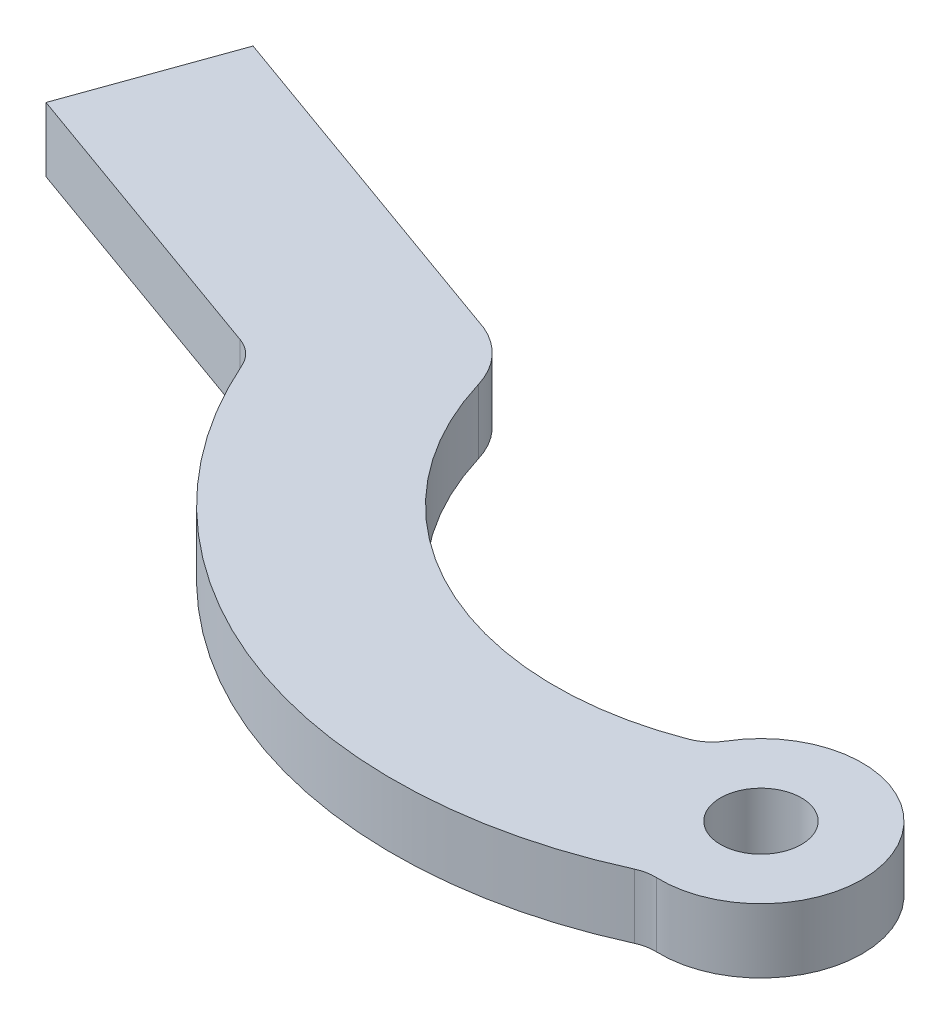
ISO-10303-21;
HEADER;
FILE_DESCRIPTION(('STEP AP214'),'2;1');
FILE_NAME('part.step','',(''),(''),'','','');
FILE_SCHEMA(('AUTOMOTIVE_DESIGN { 1 0 10303 214 1 1 1 1 }'));
ENDSEC;
DATA;
#1=APPLICATION_CONTEXT('core data for automotive mechanical design processes');
#2=APPLICATION_PROTOCOL_DEFINITION('international standard','automotive_design',2000,#1);
#3=PRODUCT_CONTEXT('',#1,'mechanical');
#4=PRODUCT('Part','Part','',(#3));
#5=PRODUCT_RELATED_PRODUCT_CATEGORY('part','',(#4));
#6=PRODUCT_DEFINITION_FORMATION('','',#4);
#7=PRODUCT_DEFINITION_CONTEXT('part definition',#1,'design');
#8=PRODUCT_DEFINITION('design','',#6,#7);
#9=PRODUCT_DEFINITION_SHAPE('','',#8);
#10=(LENGTH_UNIT() NAMED_UNIT(*) SI_UNIT(.MILLI.,.METRE.));
#11=(NAMED_UNIT(*) PLANE_ANGLE_UNIT() SI_UNIT($,.RADIAN.));
#12=(NAMED_UNIT(*) SI_UNIT($,.STERADIAN.) SOLID_ANGLE_UNIT());
#13=UNCERTAINTY_MEASURE_WITH_UNIT(LENGTH_MEASURE(1.E-05),#10,'distance_accuracy_value','');
#14=(GEOMETRIC_REPRESENTATION_CONTEXT(3) GLOBAL_UNCERTAINTY_ASSIGNED_CONTEXT((#13)) GLOBAL_UNIT_ASSIGNED_CONTEXT((#10,
#11,#12)) REPRESENTATION_CONTEXT('',''));
#15=CARTESIAN_POINT('',(0.,0.,0.));
#16=DIRECTION('',(0.,0.,1.));
#17=DIRECTION('',(1.,0.,0.));
#18=AXIS2_PLACEMENT_3D('',#15,#16,#17);
#19=CARTESIAN_POINT('',(-5.43070103723116,1.59,-8.07463832148617));
#20=DIRECTION('',(0.,-1.,0.));
#21=DIRECTION('',(0.,0.,-1.));
#22=AXIS2_PLACEMENT_3D('',#19,#20,#21);
#23=CYLINDRICAL_SURFACE('',#22,7.73099675154589);
#24=CARTESIAN_POINT('',(-5.43070103723116,0.,-8.07463832148617));
#25=DIRECTION('',(0.,1.,0.));
#26=DIRECTION('',(0.,0.,1.));
#27=AXIS2_PLACEMENT_3D('',#24,#25,#26);
#28=CIRCLE('',#27,7.73099675154589);
#29=CARTESIAN_POINT('',(-12.8368744273472,0.,-5.85722846132268));
#30=VERTEX_POINT('',#29);
#31=CARTESIAN_POINT('',(-2.64329068294313,0.,-0.863629079416032));
#32=VERTEX_POINT('',#31);
#33=EDGE_CURVE('E147',#30,#32,#28,.T.);
#34=ORIENTED_EDGE('',*,*,#33,.F.);
#35=DIRECTION('',(0.,-1.,0.));
#36=VECTOR('',#35,1.);
#37=CARTESIAN_POINT('',(-12.8368744273472,1.59,-5.85722846132268));
#38=LINE('',#37,#36);
#39=CARTESIAN_POINT('',(-12.8368744273472,1.59,-5.85722846132268));
#40=VERTEX_POINT('',#39);
#41=EDGE_CURVE('E11',#40,#30,#38,.T.);
#42=ORIENTED_EDGE('',*,*,#41,.F.);
#43=CARTESIAN_POINT('',(-5.43070103723116,1.59,-8.07463832148617));
#44=DIRECTION('',(0.,1.,0.));
#45=DIRECTION('',(0.,0.,1.));
#46=AXIS2_PLACEMENT_3D('',#43,#44,#45);
#47=CIRCLE('',#46,7.73099675154589);
#48=CARTESIAN_POINT('',(-2.64329068294313,1.59,-0.863629079416032));
#49=VERTEX_POINT('',#48);
#50=EDGE_CURVE('E239',#40,#49,#47,.T.);
#51=ORIENTED_EDGE('',*,*,#50,.T.);
#52=DIRECTION('',(0.,-1.,0.));
#53=VECTOR('',#52,1.);
#54=CARTESIAN_POINT('',(-2.64329068294313,1.59,-0.863629079416032));
#55=LINE('',#54,#53);
#56=EDGE_CURVE('E52',#49,#32,#55,.T.);
#57=ORIENTED_EDGE('',*,*,#56,.T.);
#58=EDGE_LOOP('',(#34,#42,#51,#57));
#59=FACE_BOUND('',#58,.T.);
#60=ADVANCED_FACE('F35',(#59),#23,.F.);
#61=CARTESIAN_POINT('',(-14.7596392078908,1.59,-5.28155228435894));
#62=DIRECTION('',(0.,-1.,0.));
#63=DIRECTION('',(0.,0.,-1.));
#64=AXIS2_PLACEMENT_3D('',#61,#62,#63);
#65=CYLINDRICAL_SURFACE('',#64,2.0070942832918);
#66=CARTESIAN_POINT('',(-14.7596392078908,0.,-5.28155228435894));
#67=DIRECTION('',(0.,1.,0.));
#68=DIRECTION('',(0.,0.,1.));
#69=AXIS2_PLACEMENT_3D('',#66,#67,#68);
#70=CIRCLE('',#69,2.0070942832918);
#71=CARTESIAN_POINT('',(-13.9825676529484,0.,-7.13211632284073));
#72=VERTEX_POINT('',#71);
#73=EDGE_CURVE('E149',#30,#72,#70,.T.);
#74=ORIENTED_EDGE('',*,*,#73,.T.);
#75=DIRECTION('',(0.,-1.,0.));
#76=VECTOR('',#75,1.);
#77=CARTESIAN_POINT('',(-13.9825676529484,1.59,-7.13211632284073));
#78=LINE('',#77,#76);
#79=CARTESIAN_POINT('',(-13.9825676529484,1.59,-7.13211632284073));
#80=VERTEX_POINT('',#79);
#81=EDGE_CURVE('E44',#80,#72,#78,.T.);
#82=ORIENTED_EDGE('',*,*,#81,.F.);
#83=CARTESIAN_POINT('',(-14.7596392078908,1.59,-5.28155228435894));
#84=DIRECTION('',(0.,1.,0.));
#85=DIRECTION('',(0.,0.,1.));
#86=AXIS2_PLACEMENT_3D('',#83,#84,#85);
#87=CIRCLE('',#86,2.0070942832918);
#88=EDGE_CURVE('E241',#40,#80,#87,.T.);
#89=ORIENTED_EDGE('',*,*,#88,.F.);
#90=ORIENTED_EDGE('',*,*,#41,.T.);
#91=EDGE_LOOP('',(#74,#82,#89,#90));
#92=FACE_BOUND('',#91,.T.);
#93=ADVANCED_FACE('F195',(#92),#65,.T.);
#94=CARTESIAN_POINT('',(0.674338091003313,1.59,-1.88288824390138));
#95=DIRECTION('',(-0.337169045501656,0.,0.941444121950688));
#96=DIRECTION('',(0.941444121950688,0.,0.337169045501656));
#97=AXIS2_PLACEMENT_3D('',#94,#95,#96);
#98=PLANE('',#97);
#99=DIRECTION('',(-0.941444121950688,0.,-0.337169045501656));
#100=VECTOR('',#99,1.);
#101=CARTESIAN_POINT('',(0.674338091003313,0.,-1.88288824390138));
#102=LINE('',#101,#100);
#103=CARTESIAN_POINT('',(-22.8617649577639,0.,-10.3121143814428));
#104=VERTEX_POINT('',#103);
#105=EDGE_CURVE('E152',#72,#104,#102,.T.);
#106=ORIENTED_EDGE('',*,*,#105,.T.);
#107=DIRECTION('',(0.,-1.,0.));
#108=VECTOR('',#107,1.);
#109=CARTESIAN_POINT('',(-22.8617649577639,1.59,-10.3121143814428));
#110=LINE('',#109,#108);
#111=CARTESIAN_POINT('',(-22.8617649577639,1.59,-10.3121143814428));
#112=VERTEX_POINT('',#111);
#113=EDGE_CURVE('E183',#112,#104,#110,.T.);
#114=ORIENTED_EDGE('',*,*,#113,.F.);
#115=DIRECTION('',(-0.941444121950688,0.,-0.337169045501656));
#116=VECTOR('',#115,1.);
#117=CARTESIAN_POINT('',(0.674338091003313,1.59,-1.88288824390138));
#118=LINE('',#117,#116);
#119=EDGE_CURVE('E191',#80,#112,#118,.T.);
#120=ORIENTED_EDGE('',*,*,#119,.F.);
#121=ORIENTED_EDGE('',*,*,#81,.T.);
#122=EDGE_LOOP('',(#106,#114,#120,#121));
#123=FACE_BOUND('',#122,.T.);
#124=ADVANCED_FACE('F188',(#123),#98,.F.);
#125=CARTESIAN_POINT('',(-23.5361030487672,1.59,-8.42922613754141));
#126=DIRECTION('',(0.941444121950688,0.,0.337169045501656));
#127=DIRECTION('',(0.337169045501656,0.,-0.941444121950688));
#128=AXIS2_PLACEMENT_3D('',#125,#126,#127);
#129=PLANE('',#128);
#130=DIRECTION('',(-0.337169045501656,0.,0.941444121950688));
#131=VECTOR('',#130,1.);
#132=CARTESIAN_POINT('',(-23.5361030487672,0.,-8.42922613754141));
#133=LINE('',#132,#131);
#134=CARTESIAN_POINT('',(-24.2104411397705,0.,-6.54633789364004));
#135=VERTEX_POINT('',#134);
#136=EDGE_CURVE('E155',#104,#135,#133,.T.);
#137=ORIENTED_EDGE('',*,*,#136,.T.);
#138=DIRECTION('',(0.,-1.,0.));
#139=VECTOR('',#138,1.);
#140=CARTESIAN_POINT('',(-24.2104411397705,1.59,-6.54633789364004));
#141=LINE('',#140,#139);
#142=CARTESIAN_POINT('',(-24.2104411397705,1.59,-6.54633789364004));
#143=VERTEX_POINT('',#142);
#144=EDGE_CURVE('E181',#143,#135,#141,.T.);
#145=ORIENTED_EDGE('',*,*,#144,.F.);
#146=DIRECTION('',(-0.337169045501656,0.,0.941444121950688));
#147=VECTOR('',#146,1.);
#148=CARTESIAN_POINT('',(-23.5361030487672,1.59,-8.42922613754141));
#149=LINE('',#148,#147);
#150=EDGE_CURVE('E246',#112,#143,#149,.T.);
#151=ORIENTED_EDGE('',*,*,#150,.F.);
#152=ORIENTED_EDGE('',*,*,#113,.T.);
#153=EDGE_LOOP('',(#137,#145,#151,#152));
#154=FACE_BOUND('',#153,.T.);
#155=ADVANCED_FACE('F206',(#154),#129,.F.);
#156=CARTESIAN_POINT('',(-0.674338091003315,1.59,1.88288824390138));
#157=DIRECTION('',(-0.337169045501657,0.,0.941444121950688));
#158=DIRECTION('',(0.941444121950688,0.,0.337169045501657));
#159=AXIS2_PLACEMENT_3D('',#156,#157,#158);
#160=PLANE('',#159);
#161=DIRECTION('',(-0.941444121950688,0.,-0.337169045501657));
#162=VECTOR('',#161,1.);
#163=CARTESIAN_POINT('',(-0.674338091003315,0.,1.88288824390138));
#164=LINE('',#163,#162);
#165=CARTESIAN_POINT('',(-16.7382082650292,0.,-3.87023044615566));
#166=VERTEX_POINT('',#165);
#167=EDGE_CURVE('E158',#166,#135,#164,.T.);
#168=ORIENTED_EDGE('',*,*,#167,.F.);
#169=DIRECTION('',(0.,-1.,0.));
#170=VECTOR('',#169,1.);
#171=CARTESIAN_POINT('',(-16.7382082650292,1.59,-3.87023044615566));
#172=LINE('',#171,#170);
#173=CARTESIAN_POINT('',(-16.7382082650292,1.59,-3.87023044615566));
#174=VERTEX_POINT('',#173);
#175=EDGE_CURVE('E179',#174,#166,#172,.T.);
#176=ORIENTED_EDGE('',*,*,#175,.F.);
#177=DIRECTION('',(-0.941444121950688,0.,-0.337169045501657));
#178=VECTOR('',#177,1.);
#179=CARTESIAN_POINT('',(-0.674338091003315,1.59,1.88288824390138));
#180=LINE('',#179,#178);
#181=EDGE_CURVE('E248',#174,#143,#180,.T.);
#182=ORIENTED_EDGE('',*,*,#181,.T.);
#183=ORIENTED_EDGE('',*,*,#144,.T.);
#184=EDGE_LOOP('',(#168,#176,#182,#183));
#185=FACE_BOUND('',#184,.T.);
#186=ADVANCED_FACE('F209',(#185),#160,.T.);
#187=CARTESIAN_POINT('',(-17.0753773105309,1.59,-2.92878632420497));
#188=DIRECTION('',(0.,-1.,0.));
#189=DIRECTION('',(0.,0.,-1.));
#190=AXIS2_PLACEMENT_3D('',#187,#188,#189);
#191=CYLINDRICAL_SURFACE('',#190,1.);
#192=CARTESIAN_POINT('',(-17.0753773105309,0.,-2.92878632420497));
#193=DIRECTION('',(0.,1.,0.));
#194=DIRECTION('',(0.,0.,1.));
#195=AXIS2_PLACEMENT_3D('',#192,#193,#194);
#196=CIRCLE('',#195,1.);
#197=CARTESIAN_POINT('',(-16.160706095028,0.,-3.33298499754579));
#198=VERTEX_POINT('',#197);
#199=EDGE_CURVE('E161',#198,#166,#196,.T.);
#200=ORIENTED_EDGE('',*,*,#199,.F.);
#201=DIRECTION('',(0.,-1.,0.));
#202=VECTOR('',#201,1.);
#203=CARTESIAN_POINT('',(-16.160706095028,1.59,-3.33298499754579));
#204=LINE('',#203,#202);
#205=CARTESIAN_POINT('',(-16.160706095028,1.59,-3.33298499754579));
#206=VERTEX_POINT('',#205);
#207=EDGE_CURVE('E177',#206,#198,#204,.T.);
#208=ORIENTED_EDGE('',*,*,#207,.F.);
#209=CARTESIAN_POINT('',(-17.0753773105309,1.59,-2.92878632420497));
#210=DIRECTION('',(0.,1.,0.));
#211=DIRECTION('',(0.,0.,1.));
#212=AXIS2_PLACEMENT_3D('',#209,#210,#211);
#213=CIRCLE('',#212,1.);
#214=EDGE_CURVE('E139',#206,#174,#213,.T.);
#215=ORIENTED_EDGE('',*,*,#214,.T.);
#216=ORIENTED_EDGE('',*,*,#175,.T.);
#217=EDGE_LOOP('',(#200,#208,#215,#216));
#218=FACE_BOUND('',#217,.T.);
#219=ADVANCED_FACE('F213',(#218),#191,.F.);
#220=CARTESIAN_POINT('',(-5.43070103723116,1.59,-8.07463832148617));
#221=DIRECTION('',(0.,-1.,0.));
#222=DIRECTION('',(0.,0.,-1.));
#223=AXIS2_PLACEMENT_3D('',#220,#221,#222);
#224=CYLINDRICAL_SURFACE('',#223,11.7309967515459);
#225=CARTESIAN_POINT('',(-5.43070103723116,0.,-8.07463832148617));
#226=DIRECTION('',(0.,1.,0.));
#227=DIRECTION('',(0.,0.,1.));
#228=AXIS2_PLACEMENT_3D('',#225,#226,#227);
#229=CIRCLE('',#228,11.7309967515459);
#230=CARTESIAN_POINT('',(-0.541170736149553,0.,2.58879350037986));
#231=VERTEX_POINT('',#230);
#232=EDGE_CURVE('E164',#198,#231,#229,.T.);
#233=ORIENTED_EDGE('',*,*,#232,.T.);
#234=DIRECTION('',(0.,-1.,0.));
#235=VECTOR('',#234,1.);
#236=CARTESIAN_POINT('',(-0.541170736149553,1.59,2.58879350037986));
#237=LINE('',#236,#235);
#238=CARTESIAN_POINT('',(-0.541170736149553,1.59,2.58879350037986));
#239=VERTEX_POINT('',#238);
#240=EDGE_CURVE('E124',#239,#231,#237,.T.);
#241=ORIENTED_EDGE('',*,*,#240,.F.);
#242=CARTESIAN_POINT('',(-5.43070103723116,1.59,-8.07463832148617));
#243=DIRECTION('',(0.,1.,0.));
#244=DIRECTION('',(0.,0.,1.));
#245=AXIS2_PLACEMENT_3D('',#242,#243,#244);
#246=CIRCLE('',#245,11.7309967515459);
#247=EDGE_CURVE('E136',#206,#239,#246,.T.);
#248=ORIENTED_EDGE('',*,*,#247,.F.);
#249=ORIENTED_EDGE('',*,*,#207,.T.);
#250=EDGE_LOOP('',(#233,#241,#248,#249));
#251=FACE_BOUND('',#250,.T.);
#252=ADVANCED_FACE('F217',(#251),#224,.T.);
#253=CARTESIAN_POINT('',(-0.124366401050127,1.59,3.49778973042832));
#254=DIRECTION('',(0.,-1.,0.));
#255=DIRECTION('',(0.,0.,-1.));
#256=AXIS2_PLACEMENT_3D('',#253,#254,#255);
#257=CYLINDRICAL_SURFACE('',#256,1.);
#258=CARTESIAN_POINT('',(-0.124366401050127,0.,3.49778973042832));
#259=DIRECTION('',(0.,1.,0.));
#260=DIRECTION('',(0.,0.,1.));
#261=AXIS2_PLACEMENT_3D('',#258,#259,#260);
#262=CIRCLE('',#261,1.);
#263=CARTESIAN_POINT('',(-0.0888331436072334,0.,2.49842123602023));
#264=VERTEX_POINT('',#263);
#265=EDGE_CURVE('E121',#264,#231,#262,.T.);
#266=ORIENTED_EDGE('',*,*,#265,.F.);
#267=DIRECTION('',(0.,-1.,0.));
#268=VECTOR('',#267,1.);
#269=CARTESIAN_POINT('',(-0.0888331436072334,1.59,2.49842123602023));
#270=LINE('',#269,#268);
#271=CARTESIAN_POINT('',(-0.0888331436072334,1.59,2.49842123602023));
#272=VERTEX_POINT('',#271);
#273=EDGE_CURVE('E115',#272,#264,#270,.T.);
#274=ORIENTED_EDGE('',*,*,#273,.F.);
#275=CARTESIAN_POINT('',(-0.124366401050127,1.59,3.49778973042832));
#276=DIRECTION('',(0.,1.,0.));
#277=DIRECTION('',(0.,0.,1.));
#278=AXIS2_PLACEMENT_3D('',#275,#276,#277);
#279=CIRCLE('',#278,1.);
#280=EDGE_CURVE('E119',#272,#239,#279,.T.);
#281=ORIENTED_EDGE('',*,*,#280,.T.);
#282=ORIENTED_EDGE('',*,*,#240,.T.);
#283=EDGE_LOOP('',(#266,#274,#281,#282));
#284=FACE_BOUND('',#283,.T.);
#285=ADVANCED_FACE('F117',(#284),#257,.F.);
#286=CARTESIAN_POINT('',(0.,1.59,0.));
#287=DIRECTION('',(0.,-1.,0.));
#288=DIRECTION('',(0.,0.,-1.));
#289=AXIS2_PLACEMENT_3D('',#286,#287,#288);
#290=CYLINDRICAL_SURFACE('',#289,2.5);
#291=CARTESIAN_POINT('',(0.,0.,0.));
#292=DIRECTION('',(0.,1.,0.));
#293=DIRECTION('',(0.,0.,1.));
#294=AXIS2_PLACEMENT_3D('',#291,#292,#293);
#295=CIRCLE('',#294,2.5);
#296=CARTESIAN_POINT('',(-2.14560043935836,0.,-1.28312070929637));
#297=VERTEX_POINT('',#296);
#298=EDGE_CURVE('E168',#264,#297,#295,.T.);
#299=ORIENTED_EDGE('',*,*,#298,.T.);
#300=DIRECTION('',(0.,-1.,0.));
#301=VECTOR('',#300,1.);
#302=CARTESIAN_POINT('',(-2.14560043935836,1.59,-1.28312070929637));
#303=LINE('',#302,#301);
#304=CARTESIAN_POINT('',(-2.14560043935836,1.59,-1.28312070929637));
#305=VERTEX_POINT('',#304);
#306=EDGE_CURVE('E84',#305,#297,#303,.T.);
#307=ORIENTED_EDGE('',*,*,#306,.F.);
#308=CARTESIAN_POINT('',(0.,1.59,0.));
#309=DIRECTION('',(0.,1.,0.));
#310=DIRECTION('',(0.,0.,1.));
#311=AXIS2_PLACEMENT_3D('',#308,#309,#310);
#312=CIRCLE('',#311,2.5);
#313=EDGE_CURVE('E126',#272,#305,#312,.T.);
#314=ORIENTED_EDGE('',*,*,#313,.F.);
#315=ORIENTED_EDGE('',*,*,#273,.T.);
#316=EDGE_LOOP('',(#299,#307,#314,#315));
#317=FACE_BOUND('',#316,.T.);
#318=ADVANCED_FACE('F127',(#317),#290,.T.);
#319=CARTESIAN_POINT('',(0.,1.59,0.));
#320=DIRECTION('',(0.,-1.,0.));
#321=DIRECTION('',(0.,0.,-1.));
#322=AXIS2_PLACEMENT_3D('',#319,#320,#321);
#323=CYLINDRICAL_SURFACE('',#322,1.);
#324=CARTESIAN_POINT('',(0.,1.59,0.));
#325=DIRECTION('',(0.,1.,0.));
#326=DIRECTION('',(0.,0.,1.));
#327=AXIS2_PLACEMENT_3D('',#324,#325,#326);
#328=CIRCLE('',#327,1.);
#329=CARTESIAN_POINT('',(0.,1.59,1.));
#330=VERTEX_POINT('',#329);
#331=EDGE_CURVE('E173',#330,#330,#328,.T.);
#332=ORIENTED_EDGE('',*,*,#331,.T.);
#333=EDGE_LOOP('',(#332));
#334=FACE_BOUND('',#333,.T.);
#335=CARTESIAN_POINT('',(0.,0.,0.));
#336=DIRECTION('',(0.,1.,0.));
#337=DIRECTION('',(0.,0.,1.));
#338=AXIS2_PLACEMENT_3D('',#335,#336,#337);
#339=CIRCLE('',#338,1.);
#340=CARTESIAN_POINT('',(0.,0.,1.));
#341=VERTEX_POINT('',#340);
#342=EDGE_CURVE('E144',#341,#341,#339,.T.);
#343=ORIENTED_EDGE('',*,*,#342,.F.);
#344=EDGE_LOOP('',(#343));
#345=FACE_BOUND('',#344,.T.);
#346=ADVANCED_FACE('F37',(#334,#345),#323,.F.);
#347=CARTESIAN_POINT('',(-3.0038406151017,1.59,-1.79636899301491));
#348=DIRECTION('',(0.,-1.,0.));
#349=DIRECTION('',(0.,0.,-1.));
#350=AXIS2_PLACEMENT_3D('',#347,#348,#349);
#351=CYLINDRICAL_SURFACE('',#350,1.);
#352=CARTESIAN_POINT('',(-3.0038406151017,0.,-1.79636899301491));
#353=DIRECTION('',(0.,1.,0.));
#354=DIRECTION('',(0.,0.,1.));
#355=AXIS2_PLACEMENT_3D('',#352,#353,#354);
#356=CIRCLE('',#355,1.);
#357=EDGE_CURVE('E170',#32,#297,#356,.T.);
#358=ORIENTED_EDGE('',*,*,#357,.F.);
#359=ORIENTED_EDGE('',*,*,#56,.F.);
#360=CARTESIAN_POINT('',(-3.0038406151017,1.59,-1.79636899301491));
#361=DIRECTION('',(0.,1.,0.));
#362=DIRECTION('',(0.,0.,1.));
#363=AXIS2_PLACEMENT_3D('',#360,#361,#362);
#364=CIRCLE('',#363,1.);
#365=EDGE_CURVE('E130',#49,#305,#364,.T.);
#366=ORIENTED_EDGE('',*,*,#365,.T.);
#367=ORIENTED_EDGE('',*,*,#306,.T.);
#368=EDGE_LOOP('',(#358,#359,#366,#367));
#369=FACE_BOUND('',#368,.T.);
#370=ADVANCED_FACE('F226',(#369),#351,.F.);
#371=CARTESIAN_POINT('',(0.,1.59,0.));
#372=DIRECTION('',(0.,1.,0.));
#373=DIRECTION('',(0.,0.,1.));
#374=AXIS2_PLACEMENT_3D('',#371,#372,#373);
#375=PLANE('',#374);
#376=ORIENTED_EDGE('',*,*,#331,.F.);
#377=EDGE_LOOP('',(#376));
#378=FACE_BOUND('',#377,.T.);
#379=ORIENTED_EDGE('',*,*,#50,.F.);
#380=ORIENTED_EDGE('',*,*,#88,.T.);
#381=ORIENTED_EDGE('',*,*,#119,.T.);
#382=ORIENTED_EDGE('',*,*,#150,.T.);
#383=ORIENTED_EDGE('',*,*,#181,.F.);
#384=ORIENTED_EDGE('',*,*,#214,.F.);
#385=ORIENTED_EDGE('',*,*,#247,.T.);
#386=ORIENTED_EDGE('',*,*,#280,.F.);
#387=ORIENTED_EDGE('',*,*,#313,.T.);
#388=ORIENTED_EDGE('',*,*,#365,.F.);
#389=EDGE_LOOP('',(#379,#380,#381,#382,#383,#384,#385,#386,#387,#388));
#390=FACE_BOUND('',#389,.T.);
#391=ADVANCED_FACE('F133',(#378,#390),#375,.T.);
#392=CARTESIAN_POINT('',(0.,0.,0.));
#393=DIRECTION('',(0.,1.,0.));
#394=DIRECTION('',(0.,0.,1.));
#395=AXIS2_PLACEMENT_3D('',#392,#393,#394);
#396=PLANE('',#395);
#397=ORIENTED_EDGE('',*,*,#342,.T.);
#398=EDGE_LOOP('',(#397));
#399=FACE_BOUND('',#398,.T.);
#400=ORIENTED_EDGE('',*,*,#33,.T.);
#401=ORIENTED_EDGE('',*,*,#357,.T.);
#402=ORIENTED_EDGE('',*,*,#298,.F.);
#403=ORIENTED_EDGE('',*,*,#265,.T.);
#404=ORIENTED_EDGE('',*,*,#232,.F.);
#405=ORIENTED_EDGE('',*,*,#199,.T.);
#406=ORIENTED_EDGE('',*,*,#167,.T.);
#407=ORIENTED_EDGE('',*,*,#136,.F.);
#408=ORIENTED_EDGE('',*,*,#105,.F.);
#409=ORIENTED_EDGE('',*,*,#73,.F.);
#410=EDGE_LOOP('',(#400,#401,#402,#403,#404,#405,#406,#407,#408,#409));
#411=FACE_BOUND('',#410,.T.);
#412=ADVANCED_FACE('F197',(#399,#411),#396,.F.);
#413=CLOSED_SHELL('',(#60,#93,#124,#155,#186,#219,#252,#285,#318,#346,#370,#391,#412));
#414=MANIFOLD_SOLID_BREP('B2',#413);
#415=ADVANCED_BREP_SHAPE_REPRESENTATION('',(#18,#414),#14);
#416=SHAPE_DEFINITION_REPRESENTATION(#9,#415);
ENDSEC;
END-ISO-10303-21;
